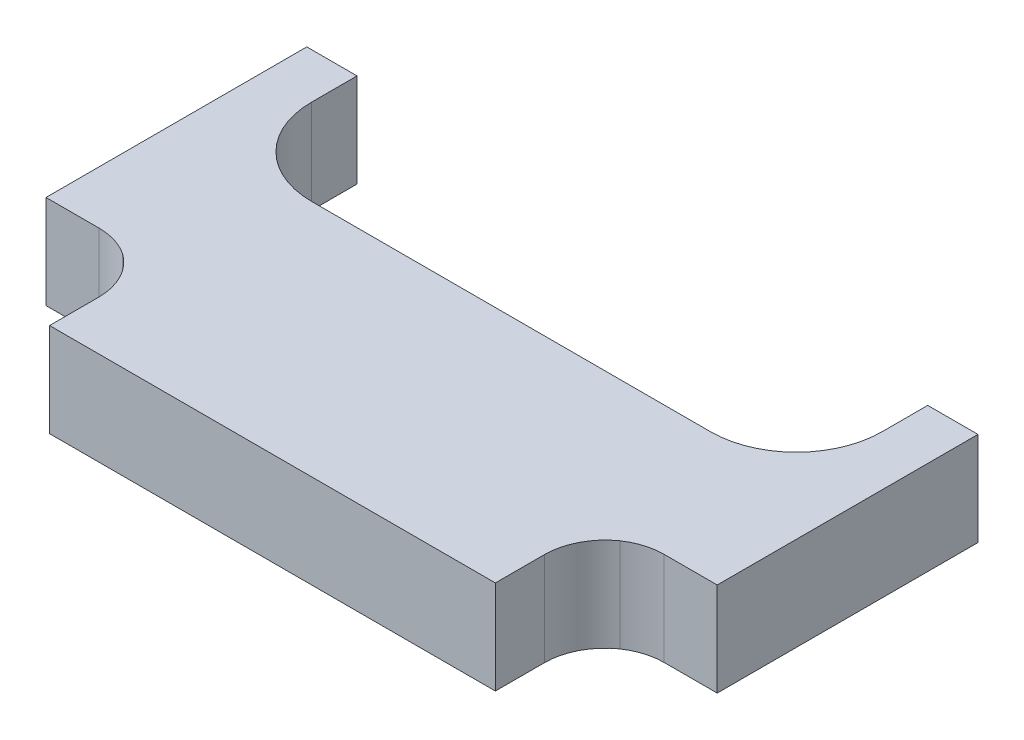
ISO-10303-21;
HEADER;
FILE_DESCRIPTION(('STEP AP214'),'2;1');
FILE_NAME('part.step','',(''),(''),'','','');
FILE_SCHEMA(('AUTOMOTIVE_DESIGN { 1 0 10303 214 1 1 1 1 }'));
ENDSEC;
DATA;
#1=APPLICATION_CONTEXT('core data for automotive mechanical design processes');
#2=APPLICATION_PROTOCOL_DEFINITION('international standard','automotive_design',2000,#1);
#3=PRODUCT_CONTEXT('',#1,'mechanical');
#4=PRODUCT('Part','Part','',(#3));
#5=PRODUCT_RELATED_PRODUCT_CATEGORY('part','',(#4));
#6=PRODUCT_DEFINITION_FORMATION('','',#4);
#7=PRODUCT_DEFINITION_CONTEXT('part definition',#1,'design');
#8=PRODUCT_DEFINITION('design','',#6,#7);
#9=PRODUCT_DEFINITION_SHAPE('','',#8);
#10=(LENGTH_UNIT() NAMED_UNIT(*) SI_UNIT(.MILLI.,.METRE.));
#11=(NAMED_UNIT(*) PLANE_ANGLE_UNIT() SI_UNIT($,.RADIAN.));
#12=(NAMED_UNIT(*) SI_UNIT($,.STERADIAN.) SOLID_ANGLE_UNIT());
#13=UNCERTAINTY_MEASURE_WITH_UNIT(LENGTH_MEASURE(1.E-05),#10,'distance_accuracy_value','');
#14=(GEOMETRIC_REPRESENTATION_CONTEXT(3) GLOBAL_UNCERTAINTY_ASSIGNED_CONTEXT((#13)) GLOBAL_UNIT_ASSIGNED_CONTEXT((#10,
#11,#12)) REPRESENTATION_CONTEXT('',''));
#15=CARTESIAN_POINT('',(0.,0.,0.));
#16=DIRECTION('',(0.,0.,1.));
#17=DIRECTION('',(1.,0.,0.));
#18=AXIS2_PLACEMENT_3D('',#15,#16,#17);
#19=CARTESIAN_POINT('',(-6.39,1.5,-4.465));
#20=DIRECTION('',(0.,-1.,0.));
#21=DIRECTION('',(0.,0.,-1.));
#22=AXIS2_PLACEMENT_3D('',#19,#20,#21);
#23=CYLINDRICAL_SURFACE('',#22,2.75);
#24=CARTESIAN_POINT('',(-6.39,-1.5,-4.465));
#25=DIRECTION('',(0.,-1.,0.));
#26=DIRECTION('',(0.,0.,1.));
#27=AXIS2_PLACEMENT_3D('',#24,#25,#26);
#28=CIRCLE('',#27,2.75);
#29=CARTESIAN_POINT('',(-6.39000000000001,-1.5,-1.715));
#30=VERTEX_POINT('',#29);
#31=CARTESIAN_POINT('',(-9.14000000000001,-1.5,-4.465));
#32=VERTEX_POINT('',#31);
#33=EDGE_CURVE('E192',#30,#32,#28,.T.);
#34=ORIENTED_EDGE('',*,*,#33,.T.);
#35=DIRECTION('',(0.,-1.,0.));
#36=VECTOR('',#35,1.);
#37=CARTESIAN_POINT('',(-9.14000000000001,1.5,-4.465));
#38=LINE('',#37,#36);
#39=CARTESIAN_POINT('',(-9.14000000000001,1.5,-4.465));
#40=VERTEX_POINT('',#39);
#41=EDGE_CURVE('E11',#40,#32,#38,.T.);
#42=ORIENTED_EDGE('',*,*,#41,.F.);
#43=CARTESIAN_POINT('',(-6.39,1.5,-4.465));
#44=DIRECTION('',(0.,-1.,0.));
#45=DIRECTION('',(0.,0.,1.));
#46=AXIS2_PLACEMENT_3D('',#43,#44,#45);
#47=CIRCLE('',#46,2.75);
#48=CARTESIAN_POINT('',(-6.39000000000001,1.5,-1.715));
#49=VERTEX_POINT('',#48);
#50=EDGE_CURVE('E226',#49,#40,#47,.T.);
#51=ORIENTED_EDGE('',*,*,#50,.F.);
#52=DIRECTION('',(0.,-1.,0.));
#53=VECTOR('',#52,1.);
#54=CARTESIAN_POINT('',(-6.39000000000001,1.5,-1.715));
#55=LINE('',#54,#53);
#56=EDGE_CURVE('E188',#49,#30,#55,.T.);
#57=ORIENTED_EDGE('',*,*,#56,.T.);
#58=EDGE_LOOP('',(#34,#42,#51,#57));
#59=FACE_BOUND('',#58,.T.);
#60=ADVANCED_FACE('F36',(#59),#23,.F.);
#61=CARTESIAN_POINT('',(-9.14000000000001,1.5,-4.465));
#62=DIRECTION('',(-1.,0.,0.));
#63=DIRECTION('',(0.,0.,1.));
#64=AXIS2_PLACEMENT_3D('',#61,#62,#63);
#65=PLANE('',#64);
#66=DIRECTION('',(0.,0.,-1.));
#67=VECTOR('',#66,1.);
#68=CARTESIAN_POINT('',(-9.14000000000001,-1.5,-4.465));
#69=LINE('',#68,#67);
#70=CARTESIAN_POINT('',(-9.14000000000001,-1.5,-5.925));
#71=VERTEX_POINT('',#70);
#72=EDGE_CURVE('E195',#32,#71,#69,.T.);
#73=ORIENTED_EDGE('',*,*,#72,.T.);
#74=DIRECTION('',(0.,-1.,0.));
#75=VECTOR('',#74,1.);
#76=CARTESIAN_POINT('',(-9.14000000000001,1.5,-5.925));
#77=LINE('',#76,#75);
#78=CARTESIAN_POINT('',(-9.14000000000001,1.5,-5.925));
#79=VERTEX_POINT('',#78);
#80=EDGE_CURVE('E44',#79,#71,#77,.T.);
#81=ORIENTED_EDGE('',*,*,#80,.F.);
#82=DIRECTION('',(0.,0.,-1.));
#83=VECTOR('',#82,1.);
#84=CARTESIAN_POINT('',(-9.14000000000001,1.5,-4.465));
#85=LINE('',#84,#83);
#86=EDGE_CURVE('E125',#40,#79,#85,.T.);
#87=ORIENTED_EDGE('',*,*,#86,.F.);
#88=ORIENTED_EDGE('',*,*,#41,.T.);
#89=EDGE_LOOP('',(#73,#81,#87,#88));
#90=FACE_BOUND('',#89,.T.);
#91=ADVANCED_FACE('F334',(#90),#65,.F.);
#92=CARTESIAN_POINT('',(-10.75,1.5,-5.925));
#93=DIRECTION('',(0.,0.,1.));
#94=DIRECTION('',(1.,0.,0.));
#95=AXIS2_PLACEMENT_3D('',#92,#93,#94);
#96=PLANE('',#95);
#97=DIRECTION('',(-1.,0.,0.));
#98=VECTOR('',#97,1.);
#99=CARTESIAN_POINT('',(-10.75,-1.5,-5.925));
#100=LINE('',#99,#98);
#101=CARTESIAN_POINT('',(-10.75,-1.5,-5.925));
#102=VERTEX_POINT('',#101);
#103=EDGE_CURVE('E197',#71,#102,#100,.T.);
#104=ORIENTED_EDGE('',*,*,#103,.T.);
#105=DIRECTION('',(0.,-1.,0.));
#106=VECTOR('',#105,1.);
#107=CARTESIAN_POINT('',(-10.75,1.5,-5.925));
#108=LINE('',#107,#106);
#109=CARTESIAN_POINT('',(-10.75,1.5,-5.925));
#110=VERTEX_POINT('',#109);
#111=EDGE_CURVE('E263',#110,#102,#108,.T.);
#112=ORIENTED_EDGE('',*,*,#111,.F.);
#113=DIRECTION('',(-1.,0.,0.));
#114=VECTOR('',#113,1.);
#115=CARTESIAN_POINT('',(-10.75,1.5,-5.925));
#116=LINE('',#115,#114);
#117=EDGE_CURVE('E271',#79,#110,#116,.T.);
#118=ORIENTED_EDGE('',*,*,#117,.F.);
#119=ORIENTED_EDGE('',*,*,#80,.T.);
#120=EDGE_LOOP('',(#104,#112,#118,#119));
#121=FACE_BOUND('',#120,.T.);
#122=ADVANCED_FACE('F269',(#121),#96,.F.);
#123=CARTESIAN_POINT('',(-10.75,1.5,-5.925));
#124=DIRECTION('',(1.,0.,0.));
#125=DIRECTION('',(0.,0.,-1.));
#126=AXIS2_PLACEMENT_3D('',#123,#124,#125);
#127=PLANE('',#126);
#128=DIRECTION('',(0.,0.,1.));
#129=VECTOR('',#128,1.);
#130=CARTESIAN_POINT('',(-10.75,-1.5,-5.925));
#131=LINE('',#130,#129);
#132=CARTESIAN_POINT('',(-10.75,-1.5,2.4288853129));
#133=VERTEX_POINT('',#132);
#134=EDGE_CURVE('E199',#102,#133,#131,.T.);
#135=ORIENTED_EDGE('',*,*,#134,.T.);
#136=DIRECTION('',(0.,-1.,0.));
#137=VECTOR('',#136,1.);
#138=CARTESIAN_POINT('',(-10.75,1.5,2.4288853129));
#139=LINE('',#138,#137);
#140=CARTESIAN_POINT('',(-10.75,1.5,2.4288853129));
#141=VERTEX_POINT('',#140);
#142=EDGE_CURVE('E260',#141,#133,#139,.T.);
#143=ORIENTED_EDGE('',*,*,#142,.F.);
#144=DIRECTION('',(0.,0.,1.));
#145=VECTOR('',#144,1.);
#146=CARTESIAN_POINT('',(-10.75,1.5,-5.925));
#147=LINE('',#146,#145);
#148=EDGE_CURVE('E289',#110,#141,#147,.T.);
#149=ORIENTED_EDGE('',*,*,#148,.F.);
#150=ORIENTED_EDGE('',*,*,#111,.T.);
#151=EDGE_LOOP('',(#135,#143,#149,#150));
#152=FACE_BOUND('',#151,.T.);
#153=ADVANCED_FACE('F280',(#152),#127,.F.);
#154=CARTESIAN_POINT('',(-10.75,1.5,2.4288853129));
#155=DIRECTION('',(0.,0.,-1.));
#156=DIRECTION('',(-1.,0.,0.));
#157=AXIS2_PLACEMENT_3D('',#154,#155,#156);
#158=PLANE('',#157);
#159=DIRECTION('',(1.,0.,0.));
#160=VECTOR('',#159,1.);
#161=CARTESIAN_POINT('',(-10.75,-1.5,2.4288853129));
#162=LINE('',#161,#160);
#163=CARTESIAN_POINT('',(-9.0533249581,-1.5,2.4288853129));
#164=VERTEX_POINT('',#163);
#165=EDGE_CURVE('E201',#133,#164,#162,.T.);
#166=ORIENTED_EDGE('',*,*,#165,.T.);
#167=DIRECTION('',(0.,-1.,0.));
#168=VECTOR('',#167,1.);
#169=CARTESIAN_POINT('',(-9.0533249581,1.5,2.4288853129));
#170=LINE('',#169,#168);
#171=CARTESIAN_POINT('',(-9.0533249581,1.5,2.4288853129));
#172=VERTEX_POINT('',#171);
#173=EDGE_CURVE('E257',#172,#164,#170,.T.);
#174=ORIENTED_EDGE('',*,*,#173,.F.);
#175=DIRECTION('',(1.,0.,0.));
#176=VECTOR('',#175,1.);
#177=CARTESIAN_POINT('',(-10.75,1.5,2.4288853129));
#178=LINE('',#177,#176);
#179=EDGE_CURVE('E286',#141,#172,#178,.T.);
#180=ORIENTED_EDGE('',*,*,#179,.F.);
#181=ORIENTED_EDGE('',*,*,#142,.T.);
#182=EDGE_LOOP('',(#166,#174,#180,#181));
#183=FACE_BOUND('',#182,.T.);
#184=ADVANCED_FACE('F284',(#183),#158,.F.);
#185=CARTESIAN_POINT('',(-9.0533249581,1.5,4.3788853129));
#186=DIRECTION('',(0.,-1.,0.));
#187=DIRECTION('',(0.,0.,-1.));
#188=AXIS2_PLACEMENT_3D('',#185,#186,#187);
#189=CYLINDRICAL_SURFACE('',#188,1.95);
#190=CARTESIAN_POINT('',(-9.0533249581,-1.5,4.3788853129));
#191=DIRECTION('',(0.,-1.,0.));
#192=DIRECTION('',(0.,0.,1.));
#193=AXIS2_PLACEMENT_3D('',#190,#191,#192);
#194=CIRCLE('',#193,1.95);
#195=CARTESIAN_POINT('',(-7.96384225899629,-1.5,2.76162607321278));
#196=VERTEX_POINT('',#195);
#197=EDGE_CURVE('E203',#164,#196,#194,.T.);
#198=ORIENTED_EDGE('',*,*,#197,.T.);
#199=DIRECTION('',(0.,-1.,0.));
#200=VECTOR('',#199,1.);
#201=CARTESIAN_POINT('',(-7.96384225899629,1.5,2.76162607321278));
#202=LINE('',#201,#200);
#203=CARTESIAN_POINT('',(-7.96384225899629,1.5,2.76162607321278));
#204=VERTEX_POINT('',#203);
#205=EDGE_CURVE('E254',#204,#196,#202,.T.);
#206=ORIENTED_EDGE('',*,*,#205,.F.);
#207=CARTESIAN_POINT('',(-9.0533249581,1.5,4.3788853129));
#208=DIRECTION('',(0.,-1.,0.));
#209=DIRECTION('',(0.,0.,1.));
#210=AXIS2_PLACEMENT_3D('',#207,#208,#209);
#211=CIRCLE('',#210,1.95);
#212=EDGE_CURVE('E288',#172,#204,#211,.T.);
#213=ORIENTED_EDGE('',*,*,#212,.F.);
#214=ORIENTED_EDGE('',*,*,#173,.T.);
#215=EDGE_LOOP('',(#198,#206,#213,#214));
#216=FACE_BOUND('',#215,.T.);
#217=ADVANCED_FACE('F347',(#216),#189,.F.);
#218=CARTESIAN_POINT('',(-9.09000000000033,1.5,4.35356474740047));
#219=DIRECTION('',(0.,-1.,0.));
#220=DIRECTION('',(0.,0.,-1.));
#221=AXIS2_PLACEMENT_3D('',#218,#219,#220);
#222=CYLINDRICAL_SURFACE('',#221,1.94999999999943);
#223=CARTESIAN_POINT('',(-9.09000000000033,-1.5,4.35356474740047));
#224=DIRECTION('',(0.,-1.,0.));
#225=DIRECTION('',(0.,0.,1.));
#226=AXIS2_PLACEMENT_3D('',#223,#224,#225);
#227=CIRCLE('',#226,1.94999999999943);
#228=CARTESIAN_POINT('',(-7.1400000000009,-1.5,4.35356474740047));
#229=VERTEX_POINT('',#228);
#230=EDGE_CURVE('E205',#196,#229,#227,.T.);
#231=ORIENTED_EDGE('',*,*,#230,.T.);
#232=DIRECTION('',(0.,-1.,0.));
#233=VECTOR('',#232,1.);
#234=CARTESIAN_POINT('',(-7.1400000000009,1.5,4.35356474740047));
#235=LINE('',#234,#233);
#236=CARTESIAN_POINT('',(-7.1400000000009,1.5,4.35356474740047));
#237=VERTEX_POINT('',#236);
#238=EDGE_CURVE('E251',#237,#229,#235,.T.);
#239=ORIENTED_EDGE('',*,*,#238,.F.);
#240=CARTESIAN_POINT('',(-9.09000000000033,1.5,4.35356474740047));
#241=DIRECTION('',(0.,-1.,0.));
#242=DIRECTION('',(0.,0.,1.));
#243=AXIS2_PLACEMENT_3D('',#240,#241,#242);
#244=CIRCLE('',#243,1.94999999999943);
#245=EDGE_CURVE('E291',#204,#237,#244,.T.);
#246=ORIENTED_EDGE('',*,*,#245,.F.);
#247=ORIENTED_EDGE('',*,*,#205,.T.);
#248=EDGE_LOOP('',(#231,#239,#246,#247));
#249=FACE_BOUND('',#248,.T.);
#250=ADVANCED_FACE('F350',(#249),#222,.F.);
#251=CARTESIAN_POINT('',(-7.1400000000009,1.5,4.35356474740047));
#252=DIRECTION('',(1.,0.,0.));
#253=DIRECTION('',(0.,0.,-1.));
#254=AXIS2_PLACEMENT_3D('',#251,#252,#253);
#255=PLANE('',#254);
#256=DIRECTION('',(0.,0.,1.));
#257=VECTOR('',#256,1.);
#258=CARTESIAN_POINT('',(-7.1400000000009,-1.5,4.35356474740047));
#259=LINE('',#258,#257);
#260=CARTESIAN_POINT('',(-7.1400000000009,-1.5,5.92500000000046));
#261=VERTEX_POINT('',#260);
#262=EDGE_CURVE('E207',#229,#261,#259,.T.);
#263=ORIENTED_EDGE('',*,*,#262,.T.);
#264=DIRECTION('',(0.,-1.,0.));
#265=VECTOR('',#264,1.);
#266=CARTESIAN_POINT('',(-7.1400000000009,1.5,5.92500000000046));
#267=LINE('',#266,#265);
#268=CARTESIAN_POINT('',(-7.1400000000009,1.5,5.92500000000046));
#269=VERTEX_POINT('',#268);
#270=EDGE_CURVE('E248',#269,#261,#267,.T.);
#271=ORIENTED_EDGE('',*,*,#270,.F.);
#272=DIRECTION('',(0.,0.,1.));
#273=VECTOR('',#272,1.);
#274=CARTESIAN_POINT('',(-7.1400000000009,1.5,4.35356474740047));
#275=LINE('',#274,#273);
#276=EDGE_CURVE('E297',#237,#269,#275,.T.);
#277=ORIENTED_EDGE('',*,*,#276,.F.);
#278=ORIENTED_EDGE('',*,*,#238,.T.);
#279=EDGE_LOOP('',(#263,#271,#277,#278));
#280=FACE_BOUND('',#279,.T.);
#281=ADVANCED_FACE('F354',(#280),#255,.F.);
#282=CARTESIAN_POINT('',(-7.1400000000009,1.5,5.92500000000046));
#283=DIRECTION('',(0.,0.,-1.));
#284=DIRECTION('',(-1.,0.,0.));
#285=AXIS2_PLACEMENT_3D('',#282,#283,#284);
#286=PLANE('',#285);
#287=DIRECTION('',(1.,0.,0.));
#288=VECTOR('',#287,1.);
#289=CARTESIAN_POINT('',(-7.1400000000009,-1.5,5.92500000000046));
#290=LINE('',#289,#288);
#291=CARTESIAN_POINT('',(7.1399999999991,-1.5,5.92500000000046));
#292=VERTEX_POINT('',#291);
#293=EDGE_CURVE('E209',#261,#292,#290,.T.);
#294=ORIENTED_EDGE('',*,*,#293,.T.);
#295=DIRECTION('',(0.,-1.,0.));
#296=VECTOR('',#295,1.);
#297=CARTESIAN_POINT('',(7.1399999999991,1.5,5.92500000000046));
#298=LINE('',#297,#296);
#299=CARTESIAN_POINT('',(7.1399999999991,1.5,5.92500000000046));
#300=VERTEX_POINT('',#299);
#301=EDGE_CURVE('E245',#300,#292,#298,.T.);
#302=ORIENTED_EDGE('',*,*,#301,.F.);
#303=DIRECTION('',(1.,0.,0.));
#304=VECTOR('',#303,1.);
#305=CARTESIAN_POINT('',(-7.1400000000009,1.5,5.92500000000046));
#306=LINE('',#305,#304);
#307=EDGE_CURVE('E299',#269,#300,#306,.T.);
#308=ORIENTED_EDGE('',*,*,#307,.F.);
#309=ORIENTED_EDGE('',*,*,#270,.T.);
#310=EDGE_LOOP('',(#294,#302,#308,#309));
#311=FACE_BOUND('',#310,.T.);
#312=ADVANCED_FACE('F358',(#311),#286,.F.);
#313=CARTESIAN_POINT('',(7.1399999999991,1.5,5.92500000000046));
#314=DIRECTION('',(-1.,0.,0.));
#315=DIRECTION('',(0.,0.,1.));
#316=AXIS2_PLACEMENT_3D('',#313,#314,#315);
#317=PLANE('',#316);
#318=DIRECTION('',(0.,0.,-1.));
#319=VECTOR('',#318,1.);
#320=CARTESIAN_POINT('',(7.1399999999991,-1.5,5.92500000000046));
#321=LINE('',#320,#319);
#322=CARTESIAN_POINT('',(7.1399999999991,-1.5,4.35356474740047));
#323=VERTEX_POINT('',#322);
#324=EDGE_CURVE('E211',#292,#323,#321,.T.);
#325=ORIENTED_EDGE('',*,*,#324,.T.);
#326=DIRECTION('',(0.,-1.,0.));
#327=VECTOR('',#326,1.);
#328=CARTESIAN_POINT('',(7.1399999999991,1.5,4.35356474740047));
#329=LINE('',#328,#327);
#330=CARTESIAN_POINT('',(7.1399999999991,1.5,4.35356474740047));
#331=VERTEX_POINT('',#330);
#332=EDGE_CURVE('E242',#331,#323,#329,.T.);
#333=ORIENTED_EDGE('',*,*,#332,.F.);
#334=DIRECTION('',(0.,0.,-1.));
#335=VECTOR('',#334,1.);
#336=CARTESIAN_POINT('',(7.1399999999991,1.5,5.92500000000046));
#337=LINE('',#336,#335);
#338=EDGE_CURVE('E301',#300,#331,#337,.T.);
#339=ORIENTED_EDGE('',*,*,#338,.F.);
#340=ORIENTED_EDGE('',*,*,#301,.T.);
#341=EDGE_LOOP('',(#325,#333,#339,#340));
#342=FACE_BOUND('',#341,.T.);
#343=ADVANCED_FACE('F362',(#342),#317,.F.);
#344=CARTESIAN_POINT('',(9.0899999999991,1.5,4.35356474740047));
#345=DIRECTION('',(0.,-1.,0.));
#346=DIRECTION('',(0.,0.,-1.));
#347=AXIS2_PLACEMENT_3D('',#344,#345,#346);
#348=CYLINDRICAL_SURFACE('',#347,1.95);
#349=CARTESIAN_POINT('',(9.0899999999991,-1.5,4.35356474740047));
#350=DIRECTION('',(0.,-1.,0.));
#351=DIRECTION('',(0.,0.,1.));
#352=AXIS2_PLACEMENT_3D('',#349,#350,#351);
#353=CIRCLE('',#352,1.95);
#354=CARTESIAN_POINT('',(7.96384225896602,-1.5,2.76162607323262));
#355=VERTEX_POINT('',#354);
#356=EDGE_CURVE('E213',#323,#355,#353,.T.);
#357=ORIENTED_EDGE('',*,*,#356,.T.);
#358=DIRECTION('',(0.,-1.,0.));
#359=VECTOR('',#358,1.);
#360=CARTESIAN_POINT('',(7.96384225896602,1.5,2.76162607323262));
#361=LINE('',#360,#359);
#362=CARTESIAN_POINT('',(7.96384225896602,1.5,2.76162607323262));
#363=VERTEX_POINT('',#362);
#364=EDGE_CURVE('E239',#363,#355,#361,.T.);
#365=ORIENTED_EDGE('',*,*,#364,.F.);
#366=CARTESIAN_POINT('',(9.0899999999991,1.5,4.35356474740047));
#367=DIRECTION('',(0.,-1.,0.));
#368=DIRECTION('',(0.,0.,1.));
#369=AXIS2_PLACEMENT_3D('',#366,#367,#368);
#370=CIRCLE('',#369,1.95);
#371=EDGE_CURVE('E303',#331,#363,#370,.T.);
#372=ORIENTED_EDGE('',*,*,#371,.F.);
#373=ORIENTED_EDGE('',*,*,#332,.T.);
#374=EDGE_LOOP('',(#357,#365,#372,#373));
#375=FACE_BOUND('',#374,.T.);
#376=ADVANCED_FACE('F366',(#375),#348,.F.);
#377=CARTESIAN_POINT('',(9.053324958099,1.5,4.37888531290033));
#378=DIRECTION('',(0.,-1.,0.));
#379=DIRECTION('',(0.,0.,-1.));
#380=AXIS2_PLACEMENT_3D('',#377,#378,#379);
#381=CYLINDRICAL_SURFACE('',#380,1.95000000000017);
#382=CARTESIAN_POINT('',(9.053324958099,-1.5,4.37888531290033));
#383=DIRECTION('',(0.,-1.,0.));
#384=DIRECTION('',(0.,0.,1.));
#385=AXIS2_PLACEMENT_3D('',#382,#383,#384);
#386=CIRCLE('',#385,1.95000000000017);
#387=CARTESIAN_POINT('',(9.053324958099,-1.5,2.42888531290016));
#388=VERTEX_POINT('',#387);
#389=EDGE_CURVE('E215',#355,#388,#386,.T.);
#390=ORIENTED_EDGE('',*,*,#389,.T.);
#391=DIRECTION('',(0.,-1.,0.));
#392=VECTOR('',#391,1.);
#393=CARTESIAN_POINT('',(9.053324958099,1.5,2.42888531290016));
#394=LINE('',#393,#392);
#395=CARTESIAN_POINT('',(9.053324958099,1.5,2.42888531290016));
#396=VERTEX_POINT('',#395);
#397=EDGE_CURVE('E236',#396,#388,#394,.T.);
#398=ORIENTED_EDGE('',*,*,#397,.F.);
#399=CARTESIAN_POINT('',(9.053324958099,1.5,4.37888531290033));
#400=DIRECTION('',(0.,-1.,0.));
#401=DIRECTION('',(0.,0.,1.));
#402=AXIS2_PLACEMENT_3D('',#399,#400,#401);
#403=CIRCLE('',#402,1.95000000000017);
#404=EDGE_CURVE('E305',#363,#396,#403,.T.);
#405=ORIENTED_EDGE('',*,*,#404,.F.);
#406=ORIENTED_EDGE('',*,*,#364,.T.);
#407=EDGE_LOOP('',(#390,#398,#405,#406));
#408=FACE_BOUND('',#407,.T.);
#409=ADVANCED_FACE('F370',(#408),#381,.F.);
#410=CARTESIAN_POINT('',(9.053324958099,1.5,2.42888531290016));
#411=DIRECTION('',(0.,0.,-1.));
#412=DIRECTION('',(-1.,0.,0.));
#413=AXIS2_PLACEMENT_3D('',#410,#411,#412);
#414=PLANE('',#413);
#415=DIRECTION('',(1.,0.,0.));
#416=VECTOR('',#415,1.);
#417=CARTESIAN_POINT('',(9.053324958099,-1.5,2.42888531290016));
#418=LINE('',#417,#416);
#419=CARTESIAN_POINT('',(10.749999999999,-1.5,2.42888531290016));
#420=VERTEX_POINT('',#419);
#421=EDGE_CURVE('E217',#388,#420,#418,.T.);
#422=ORIENTED_EDGE('',*,*,#421,.T.);
#423=DIRECTION('',(0.,-1.,0.));
#424=VECTOR('',#423,1.);
#425=CARTESIAN_POINT('',(10.749999999999,1.5,2.42888531290016));
#426=LINE('',#425,#424);
#427=CARTESIAN_POINT('',(10.749999999999,1.5,2.42888531290016));
#428=VERTEX_POINT('',#427);
#429=EDGE_CURVE('E233',#428,#420,#426,.T.);
#430=ORIENTED_EDGE('',*,*,#429,.F.);
#431=DIRECTION('',(1.,0.,0.));
#432=VECTOR('',#431,1.);
#433=CARTESIAN_POINT('',(9.053324958099,1.5,2.42888531290016));
#434=LINE('',#433,#432);
#435=EDGE_CURVE('E307',#396,#428,#434,.T.);
#436=ORIENTED_EDGE('',*,*,#435,.F.);
#437=ORIENTED_EDGE('',*,*,#397,.T.);
#438=EDGE_LOOP('',(#422,#430,#436,#437));
#439=FACE_BOUND('',#438,.T.);
#440=ADVANCED_FACE('F374',(#439),#414,.F.);
#441=CARTESIAN_POINT('',(10.749999999999,1.5,2.42888531290016));
#442=DIRECTION('',(-1.,0.,0.));
#443=DIRECTION('',(0.,0.,1.));
#444=AXIS2_PLACEMENT_3D('',#441,#442,#443);
#445=PLANE('',#444);
#446=DIRECTION('',(0.,0.,-1.));
#447=VECTOR('',#446,1.);
#448=CARTESIAN_POINT('',(10.749999999999,-1.5,2.42888531290016));
#449=LINE('',#448,#447);
#450=CARTESIAN_POINT('',(10.749999999999,-1.5,-5.925));
#451=VERTEX_POINT('',#450);
#452=EDGE_CURVE('E219',#420,#451,#449,.T.);
#453=ORIENTED_EDGE('',*,*,#452,.T.);
#454=DIRECTION('',(0.,-1.,0.));
#455=VECTOR('',#454,1.);
#456=CARTESIAN_POINT('',(10.749999999999,1.5,-5.925));
#457=LINE('',#456,#455);
#458=CARTESIAN_POINT('',(10.749999999999,1.5,-5.925));
#459=VERTEX_POINT('',#458);
#460=EDGE_CURVE('E230',#459,#451,#457,.T.);
#461=ORIENTED_EDGE('',*,*,#460,.F.);
#462=DIRECTION('',(0.,0.,-1.));
#463=VECTOR('',#462,1.);
#464=CARTESIAN_POINT('',(10.749999999999,1.5,2.42888531290016));
#465=LINE('',#464,#463);
#466=EDGE_CURVE('E309',#428,#459,#465,.T.);
#467=ORIENTED_EDGE('',*,*,#466,.F.);
#468=ORIENTED_EDGE('',*,*,#429,.T.);
#469=EDGE_LOOP('',(#453,#461,#467,#468));
#470=FACE_BOUND('',#469,.T.);
#471=ADVANCED_FACE('F315',(#470),#445,.F.);
#472=CARTESIAN_POINT('',(10.749999999999,1.5,-5.925));
#473=DIRECTION('',(0.,0.,1.));
#474=DIRECTION('',(1.,0.,0.));
#475=AXIS2_PLACEMENT_3D('',#472,#473,#474);
#476=PLANE('',#475);
#477=DIRECTION('',(-1.,0.,0.));
#478=VECTOR('',#477,1.);
#479=CARTESIAN_POINT('',(10.749999999999,-1.5,-5.925));
#480=LINE('',#479,#478);
#481=CARTESIAN_POINT('',(9.14,-1.5,-5.925));
#482=VERTEX_POINT('',#481);
#483=EDGE_CURVE('E221',#451,#482,#480,.T.);
#484=ORIENTED_EDGE('',*,*,#483,.T.);
#485=DIRECTION('',(0.,-1.,0.));
#486=VECTOR('',#485,1.);
#487=CARTESIAN_POINT('',(9.14,1.5,-5.925));
#488=LINE('',#487,#486);
#489=CARTESIAN_POINT('',(9.14,1.5,-5.925));
#490=VERTEX_POINT('',#489);
#491=EDGE_CURVE('E183',#490,#482,#488,.T.);
#492=ORIENTED_EDGE('',*,*,#491,.F.);
#493=DIRECTION('',(-1.,0.,0.));
#494=VECTOR('',#493,1.);
#495=CARTESIAN_POINT('',(10.749999999999,1.5,-5.925));
#496=LINE('',#495,#494);
#497=EDGE_CURVE('E174',#459,#490,#496,.T.);
#498=ORIENTED_EDGE('',*,*,#497,.F.);
#499=ORIENTED_EDGE('',*,*,#460,.T.);
#500=EDGE_LOOP('',(#484,#492,#498,#499));
#501=FACE_BOUND('',#500,.T.);
#502=ADVANCED_FACE('F319',(#501),#476,.F.);
#503=CARTESIAN_POINT('',(9.14,1.5,-5.925));
#504=DIRECTION('',(1.,0.,0.));
#505=DIRECTION('',(0.,0.,-1.));
#506=AXIS2_PLACEMENT_3D('',#503,#504,#505);
#507=PLANE('',#506);
#508=DIRECTION('',(0.,0.,1.));
#509=VECTOR('',#508,1.);
#510=CARTESIAN_POINT('',(9.14,-1.5,-5.925));
#511=LINE('',#510,#509);
#512=CARTESIAN_POINT('',(9.14,-1.5,-4.465));
#513=VERTEX_POINT('',#512);
#514=EDGE_CURVE('E182',#482,#513,#511,.T.);
#515=ORIENTED_EDGE('',*,*,#514,.T.);
#516=DIRECTION('',(0.,-1.,0.));
#517=VECTOR('',#516,1.);
#518=CARTESIAN_POINT('',(9.14,1.5,-4.465));
#519=LINE('',#518,#517);
#520=CARTESIAN_POINT('',(9.14,1.5,-4.465));
#521=VERTEX_POINT('',#520);
#522=EDGE_CURVE('E179',#521,#513,#519,.T.);
#523=ORIENTED_EDGE('',*,*,#522,.F.);
#524=DIRECTION('',(0.,0.,1.));
#525=VECTOR('',#524,1.);
#526=CARTESIAN_POINT('',(9.14,1.5,-5.925));
#527=LINE('',#526,#525);
#528=EDGE_CURVE('E168',#490,#521,#527,.T.);
#529=ORIENTED_EDGE('',*,*,#528,.F.);
#530=ORIENTED_EDGE('',*,*,#491,.T.);
#531=EDGE_LOOP('',(#515,#523,#529,#530));
#532=FACE_BOUND('',#531,.T.);
#533=ADVANCED_FACE('F180',(#532),#507,.F.);
#534=CARTESIAN_POINT('',(6.39,1.5,-4.465));
#535=DIRECTION('',(0.,-1.,0.));
#536=DIRECTION('',(0.,0.,-1.));
#537=AXIS2_PLACEMENT_3D('',#534,#535,#536);
#538=CYLINDRICAL_SURFACE('',#537,2.75);
#539=CARTESIAN_POINT('',(6.39,-1.5,-4.465));
#540=DIRECTION('',(0.,-1.,0.));
#541=DIRECTION('',(0.,0.,1.));
#542=AXIS2_PLACEMENT_3D('',#539,#540,#541);
#543=CIRCLE('',#542,2.75);
#544=CARTESIAN_POINT('',(6.39,-1.5,-1.715));
#545=VERTEX_POINT('',#544);
#546=EDGE_CURVE('E111',#513,#545,#543,.T.);
#547=ORIENTED_EDGE('',*,*,#546,.T.);
#548=DIRECTION('',(0.,-1.,0.));
#549=VECTOR('',#548,1.);
#550=CARTESIAN_POINT('',(6.39,1.5,-1.715));
#551=LINE('',#550,#549);
#552=CARTESIAN_POINT('',(6.39,1.5,-1.715));
#553=VERTEX_POINT('',#552);
#554=EDGE_CURVE('E184',#553,#545,#551,.T.);
#555=ORIENTED_EDGE('',*,*,#554,.F.);
#556=CARTESIAN_POINT('',(6.39,1.5,-4.465));
#557=DIRECTION('',(0.,-1.,0.));
#558=DIRECTION('',(0.,0.,1.));
#559=AXIS2_PLACEMENT_3D('',#556,#557,#558);
#560=CIRCLE('',#559,2.75);
#561=EDGE_CURVE('E172',#521,#553,#560,.T.);
#562=ORIENTED_EDGE('',*,*,#561,.F.);
#563=ORIENTED_EDGE('',*,*,#522,.T.);
#564=EDGE_LOOP('',(#547,#555,#562,#563));
#565=FACE_BOUND('',#564,.T.);
#566=ADVANCED_FACE('F186',(#565),#538,.F.);
#567=CARTESIAN_POINT('',(6.39,1.5,-1.715));
#568=DIRECTION('',(0.,0.,1.));
#569=DIRECTION('',(1.,0.,0.));
#570=AXIS2_PLACEMENT_3D('',#567,#568,#569);
#571=PLANE('',#570);
#572=DIRECTION('',(-1.,0.,0.));
#573=VECTOR('',#572,1.);
#574=CARTESIAN_POINT('',(6.39,-1.5,-1.715));
#575=LINE('',#574,#573);
#576=EDGE_CURVE('E117',#545,#30,#575,.T.);
#577=ORIENTED_EDGE('',*,*,#576,.T.);
#578=ORIENTED_EDGE('',*,*,#56,.F.);
#579=DIRECTION('',(-1.,0.,0.));
#580=VECTOR('',#579,1.);
#581=CARTESIAN_POINT('',(6.39,1.5,-1.715));
#582=LINE('',#581,#580);
#583=EDGE_CURVE('E52',#553,#49,#582,.T.);
#584=ORIENTED_EDGE('',*,*,#583,.F.);
#585=ORIENTED_EDGE('',*,*,#554,.T.);
#586=EDGE_LOOP('',(#577,#578,#584,#585));
#587=FACE_BOUND('',#586,.T.);
#588=ADVANCED_FACE('F323',(#587),#571,.F.);
#589=CARTESIAN_POINT('',(-6.39,1.5,-4.465));
#590=DIRECTION('',(0.,1.,0.));
#591=DIRECTION('',(0.,0.,1.));
#592=AXIS2_PLACEMENT_3D('',#589,#590,#591);
#593=PLANE('',#592);
#594=ORIENTED_EDGE('',*,*,#50,.T.);
#595=ORIENTED_EDGE('',*,*,#86,.T.);
#596=ORIENTED_EDGE('',*,*,#117,.T.);
#597=ORIENTED_EDGE('',*,*,#148,.T.);
#598=ORIENTED_EDGE('',*,*,#179,.T.);
#599=ORIENTED_EDGE('',*,*,#212,.T.);
#600=ORIENTED_EDGE('',*,*,#245,.T.);
#601=ORIENTED_EDGE('',*,*,#276,.T.);
#602=ORIENTED_EDGE('',*,*,#307,.T.);
#603=ORIENTED_EDGE('',*,*,#338,.T.);
#604=ORIENTED_EDGE('',*,*,#371,.T.);
#605=ORIENTED_EDGE('',*,*,#404,.T.);
#606=ORIENTED_EDGE('',*,*,#435,.T.);
#607=ORIENTED_EDGE('',*,*,#466,.T.);
#608=ORIENTED_EDGE('',*,*,#497,.T.);
#609=ORIENTED_EDGE('',*,*,#528,.T.);
#610=ORIENTED_EDGE('',*,*,#561,.T.);
#611=ORIENTED_EDGE('',*,*,#583,.T.);
#612=EDGE_LOOP('',(#594,#595,#596,#597,#598,#599,#600,#601,#602,#603,#604,#605,#606,#607,#608,
#609,#610,#611));
#613=FACE_BOUND('',#612,.T.);
#614=ADVANCED_FACE('F170',(#613),#593,.T.);
#615=CARTESIAN_POINT('',(-6.39,-1.5,-4.465));
#616=DIRECTION('',(0.,1.,0.));
#617=DIRECTION('',(0.,0.,1.));
#618=AXIS2_PLACEMENT_3D('',#615,#616,#617);
#619=PLANE('',#618);
#620=ORIENTED_EDGE('',*,*,#33,.F.);
#621=ORIENTED_EDGE('',*,*,#576,.F.);
#622=ORIENTED_EDGE('',*,*,#546,.F.);
#623=ORIENTED_EDGE('',*,*,#514,.F.);
#624=ORIENTED_EDGE('',*,*,#483,.F.);
#625=ORIENTED_EDGE('',*,*,#452,.F.);
#626=ORIENTED_EDGE('',*,*,#421,.F.);
#627=ORIENTED_EDGE('',*,*,#389,.F.);
#628=ORIENTED_EDGE('',*,*,#356,.F.);
#629=ORIENTED_EDGE('',*,*,#324,.F.);
#630=ORIENTED_EDGE('',*,*,#293,.F.);
#631=ORIENTED_EDGE('',*,*,#262,.F.);
#632=ORIENTED_EDGE('',*,*,#230,.F.);
#633=ORIENTED_EDGE('',*,*,#197,.F.);
#634=ORIENTED_EDGE('',*,*,#165,.F.);
#635=ORIENTED_EDGE('',*,*,#134,.F.);
#636=ORIENTED_EDGE('',*,*,#103,.F.);
#637=ORIENTED_EDGE('',*,*,#72,.F.);
#638=EDGE_LOOP('',(#620,#621,#622,#623,#624,#625,#626,#627,#628,#629,#630,#631,#632,#633,#634,
#635,#636,#637));
#639=FACE_BOUND('',#638,.T.);
#640=ADVANCED_FACE('F275',(#639),#619,.F.);
#641=CLOSED_SHELL('',(#60,#91,#122,#153,#184,#217,#250,#281,#312,#343,#376,#409,#440,#471,#502,
#533,#566,#588,#614,#640));
#642=MANIFOLD_SOLID_BREP('B2',#641);
#643=ADVANCED_BREP_SHAPE_REPRESENTATION('',(#18,#642),#14);
#644=SHAPE_DEFINITION_REPRESENTATION(#9,#643);
ENDSEC;
END-ISO-10303-21;
